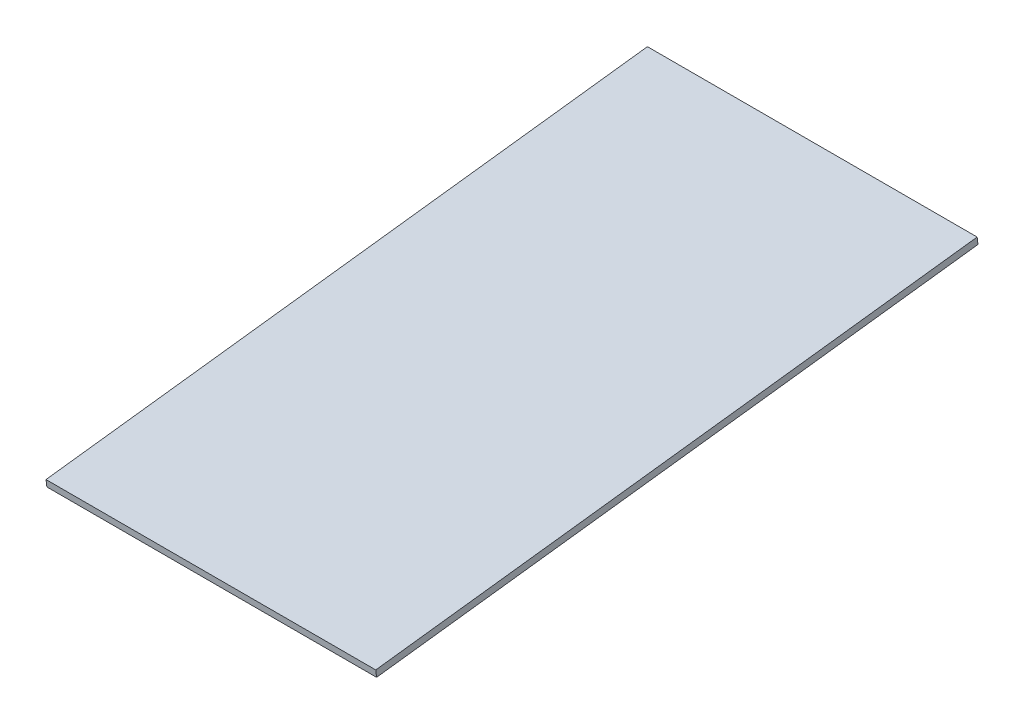
ISO-10303-21;
HEADER;
FILE_DESCRIPTION(('STEP AP214'),'2;1');
FILE_NAME('part.step','',(''),(''),'','','');
FILE_SCHEMA(('AUTOMOTIVE_DESIGN { 1 0 10303 214 1 1 1 1 }'));
ENDSEC;
DATA;
#1=APPLICATION_CONTEXT('core data for automotive mechanical design processes');
#2=APPLICATION_PROTOCOL_DEFINITION('international standard','automotive_design',2000,#1);
#3=PRODUCT_CONTEXT('',#1,'mechanical');
#4=PRODUCT('Part','Part','',(#3));
#5=PRODUCT_RELATED_PRODUCT_CATEGORY('part','',(#4));
#6=PRODUCT_DEFINITION_FORMATION('','',#4);
#7=PRODUCT_DEFINITION_CONTEXT('part definition',#1,'design');
#8=PRODUCT_DEFINITION('design','',#6,#7);
#9=PRODUCT_DEFINITION_SHAPE('','',#8);
#10=(LENGTH_UNIT() NAMED_UNIT(*) SI_UNIT(.MILLI.,.METRE.));
#11=(NAMED_UNIT(*) PLANE_ANGLE_UNIT() SI_UNIT($,.RADIAN.));
#12=(NAMED_UNIT(*) SI_UNIT($,.STERADIAN.) SOLID_ANGLE_UNIT());
#13=UNCERTAINTY_MEASURE_WITH_UNIT(LENGTH_MEASURE(1.E-05),#10,'distance_accuracy_value','');
#14=(GEOMETRIC_REPRESENTATION_CONTEXT(3) GLOBAL_UNCERTAINTY_ASSIGNED_CONTEXT((#13)) GLOBAL_UNIT_ASSIGNED_CONTEXT((#10,
#11,#12)) REPRESENTATION_CONTEXT('',''));
#15=CARTESIAN_POINT('',(0.,0.,0.));
#16=DIRECTION('',(0.,0.,1.));
#17=DIRECTION('',(1.,0.,0.));
#18=AXIS2_PLACEMENT_3D('',#15,#16,#17);
#19=CARTESIAN_POINT('',(0.,0.,-103.745100592645));
#20=DIRECTION('',(0.,-0.992478949445533,-0.122415419402504));
#21=DIRECTION('',(0.,0.122415419402504,-0.992478949445533));
#22=AXIS2_PLACEMENT_3D('',#19,#20,#21);
#23=PLANE('',#22);
#24=DIRECTION('',(1.,0.,0.));
#25=VECTOR('',#24,1.);
#26=CARTESIAN_POINT('',(0.,-2.29677388219329E-12,-103.745100592627));
#27=LINE('',#26,#25);
#28=CARTESIAN_POINT('',(0.,-1.14772667138345E-12,-103.745100592636));
#29=VERTEX_POINT('',#28);
#30=CARTESIAN_POINT('',(606.425,-1.14772667138345E-12,-103.745100592636));
#31=VERTEX_POINT('',#30);
#32=EDGE_CURVE('E20',#29,#31,#27,.T.);
#33=ORIENTED_EDGE('',*,*,#32,.F.);
#34=DIRECTION('',(0.,0.122415419402487,-0.992478949445535));
#35=VECTOR('',#34,1.);
#36=CARTESIAN_POINT('',(0.,0.,-103.745100592645));
#37=LINE('',#36,#35);
#38=CARTESIAN_POINT('',(0.,136.422803767623,-1209.78845382846));
#39=VERTEX_POINT('',#38);
#40=EDGE_CURVE('E80',#29,#39,#37,.T.);
#41=ORIENTED_EDGE('',*,*,#40,.T.);
#42=DIRECTION('',(1.,0.,0.));
#43=VECTOR('',#42,1.);
#44=CARTESIAN_POINT('',(0.,136.422803767614,-1209.78845382846));
#45=LINE('',#44,#43);
#46=CARTESIAN_POINT('',(606.425,136.422803767618,-1209.78845382846));
#47=VERTEX_POINT('',#46);
#48=EDGE_CURVE('E68',#47,#39,#45,.F.);
#49=ORIENTED_EDGE('',*,*,#48,.F.);
#50=DIRECTION('',(0.,0.122415419402487,-0.992478949445535));
#51=VECTOR('',#50,1.);
#52=CARTESIAN_POINT('',(606.425,0.,-103.745100592645));
#53=LINE('',#52,#51);
#54=EDGE_CURVE('E56',#31,#47,#53,.T.);
#55=ORIENTED_EDGE('',*,*,#54,.F.);
#56=EDGE_LOOP('',(#33,#41,#49,#55));
#57=FACE_BOUND('',#56,.T.);
#58=ADVANCED_FACE('F17',(#57),#23,.T.);
#59=CARTESIAN_POINT('',(0.,12.6044826579591,-102.190424766214));
#60=DIRECTION('',(0.,-0.122415419402504,0.992478949445533));
#61=DIRECTION('',(0.,-0.992478949445533,-0.122415419402504));
#62=AXIS2_PLACEMENT_3D('',#59,#60,#61);
#63=PLANE('',#62);
#64=DIRECTION('',(1.,0.,0.));
#65=VECTOR('',#64,1.);
#66=CARTESIAN_POINT('',(0.,12.6044826579386,-102.190424766217));
#67=LINE('',#66,#65);
#68=CARTESIAN_POINT('',(0.,12.604482657954,-102.190424766215));
#69=VERTEX_POINT('',#68);
#70=CARTESIAN_POINT('',(606.425,12.604482657954,-102.190424766215));
#71=VERTEX_POINT('',#70);
#72=EDGE_CURVE('E83',#69,#71,#67,.T.);
#73=ORIENTED_EDGE('',*,*,#72,.F.);
#74=DIRECTION('',(0.,-0.992478949445352,-0.12241541940397));
#75=VECTOR('',#74,1.);
#76=CARTESIAN_POINT('',(0.,12.6044826579591,-102.190424766214));
#77=LINE('',#76,#75);
#78=EDGE_CURVE('E65',#69,#29,#77,.T.);
#79=ORIENTED_EDGE('',*,*,#78,.T.);
#80=ORIENTED_EDGE('',*,*,#32,.T.);
#81=DIRECTION('',(0.,-0.992478949445352,-0.12241541940397));
#82=VECTOR('',#81,1.);
#83=CARTESIAN_POINT('',(606.425,12.6044826579591,-102.190424766214));
#84=LINE('',#83,#82);
#85=EDGE_CURVE('E62',#71,#31,#84,.T.);
#86=ORIENTED_EDGE('',*,*,#85,.F.);
#87=EDGE_LOOP('',(#73,#79,#80,#86));
#88=FACE_BOUND('',#87,.T.);
#89=ADVANCED_FACE('F61',(#88),#63,.T.);
#90=CARTESIAN_POINT('',(606.425,0.,0.));
#91=DIRECTION('',(1.,0.,0.));
#92=DIRECTION('',(0.,0.,-1.));
#93=AXIS2_PLACEMENT_3D('',#90,#91,#92);
#94=PLANE('',#93);
#95=DIRECTION('',(0.,0.992478949445533,0.122415419402504));
#96=VECTOR('',#95,1.);
#97=CARTESIAN_POINT('',(606.425,136.422803767614,-1209.78845382846));
#98=LINE('',#97,#96);
#99=CARTESIAN_POINT('',(606.425,149.027286425577,-1208.23377800208));
#100=VERTEX_POINT('',#99);
#101=EDGE_CURVE('E70',#100,#47,#98,.F.);
#102=ORIENTED_EDGE('',*,*,#101,.F.);
#103=DIRECTION('',(0.,-0.122415419402504,0.992478949445533));
#104=VECTOR('',#103,1.);
#105=CARTESIAN_POINT('',(606.425,149.027286425578,-1208.23377800208));
#106=LINE('',#105,#104);
#107=EDGE_CURVE('E74',#71,#100,#106,.F.);
#108=ORIENTED_EDGE('',*,*,#107,.F.);
#109=ORIENTED_EDGE('',*,*,#85,.T.);
#110=ORIENTED_EDGE('',*,*,#54,.T.);
#111=EDGE_LOOP('',(#102,#108,#109,#110));
#112=FACE_BOUND('',#111,.T.);
#113=ADVANCED_FACE('F72',(#112),#94,.T.);
#114=CARTESIAN_POINT('',(0.,136.422803767614,-1209.78845382846));
#115=DIRECTION('',(0.,0.122415419402504,-0.992478949445533));
#116=DIRECTION('',(0.,0.992478949445533,0.122415419402504));
#117=AXIS2_PLACEMENT_3D('',#114,#115,#116);
#118=PLANE('',#117);
#119=ORIENTED_EDGE('',*,*,#48,.T.);
#120=DIRECTION('',(0.,0.992478949445844,0.122415419399983));
#121=VECTOR('',#120,1.);
#122=CARTESIAN_POINT('',(0.,136.422803767614,-1209.78845382846));
#123=LINE('',#122,#121);
#124=CARTESIAN_POINT('',(0.,149.027286425576,-1208.23377800207));
#125=VERTEX_POINT('',#124);
#126=EDGE_CURVE('E35',#39,#125,#123,.T.);
#127=ORIENTED_EDGE('',*,*,#126,.T.);
#128=DIRECTION('',(1.,0.,0.));
#129=VECTOR('',#128,1.);
#130=CARTESIAN_POINT('',(0.,149.027286425578,-1208.23377800208));
#131=LINE('',#130,#129);
#132=EDGE_CURVE('E26',#100,#125,#131,.F.);
#133=ORIENTED_EDGE('',*,*,#132,.F.);
#134=ORIENTED_EDGE('',*,*,#101,.T.);
#135=EDGE_LOOP('',(#119,#127,#133,#134));
#136=FACE_BOUND('',#135,.T.);
#137=ADVANCED_FACE('F89',(#136),#118,.T.);
#138=CARTESIAN_POINT('',(0.,0.,0.));
#139=DIRECTION('',(1.,0.,0.));
#140=DIRECTION('',(0.,0.,-1.));
#141=AXIS2_PLACEMENT_3D('',#138,#139,#140);
#142=PLANE('',#141);
#143=ORIENTED_EDGE('',*,*,#40,.F.);
#144=ORIENTED_EDGE('',*,*,#78,.F.);
#145=DIRECTION('',(0.,-0.122415419402504,0.992478949445533));
#146=VECTOR('',#145,1.);
#147=CARTESIAN_POINT('',(0.,149.027286425578,-1208.23377800208));
#148=LINE('',#147,#146);
#149=EDGE_CURVE('E11',#125,#69,#148,.T.);
#150=ORIENTED_EDGE('',*,*,#149,.F.);
#151=ORIENTED_EDGE('',*,*,#126,.F.);
#152=EDGE_LOOP('',(#143,#144,#150,#151));
#153=FACE_BOUND('',#152,.T.);
#154=ADVANCED_FACE('F91',(#153),#142,.F.);
#155=CARTESIAN_POINT('',(0.,149.027286425578,-1208.23377800208));
#156=DIRECTION('',(0.,0.992478949445533,0.122415419402504));
#157=DIRECTION('',(0.,-0.122415419402504,0.992478949445533));
#158=AXIS2_PLACEMENT_3D('',#155,#156,#157);
#159=PLANE('',#158);
#160=ORIENTED_EDGE('',*,*,#132,.T.);
#161=ORIENTED_EDGE('',*,*,#149,.T.);
#162=ORIENTED_EDGE('',*,*,#72,.T.);
#163=ORIENTED_EDGE('',*,*,#107,.T.);
#164=EDGE_LOOP('',(#160,#161,#162,#163));
#165=FACE_BOUND('',#164,.T.);
#166=ADVANCED_FACE('F88',(#165),#159,.T.);
#167=CLOSED_SHELL('',(#58,#89,#113,#137,#154,#166));
#168=MANIFOLD_SOLID_BREP('B1',#167);
#169=ADVANCED_BREP_SHAPE_REPRESENTATION('',(#18,#168),#14);
#170=SHAPE_DEFINITION_REPRESENTATION(#9,#169);
ENDSEC;
END-ISO-10303-21;
